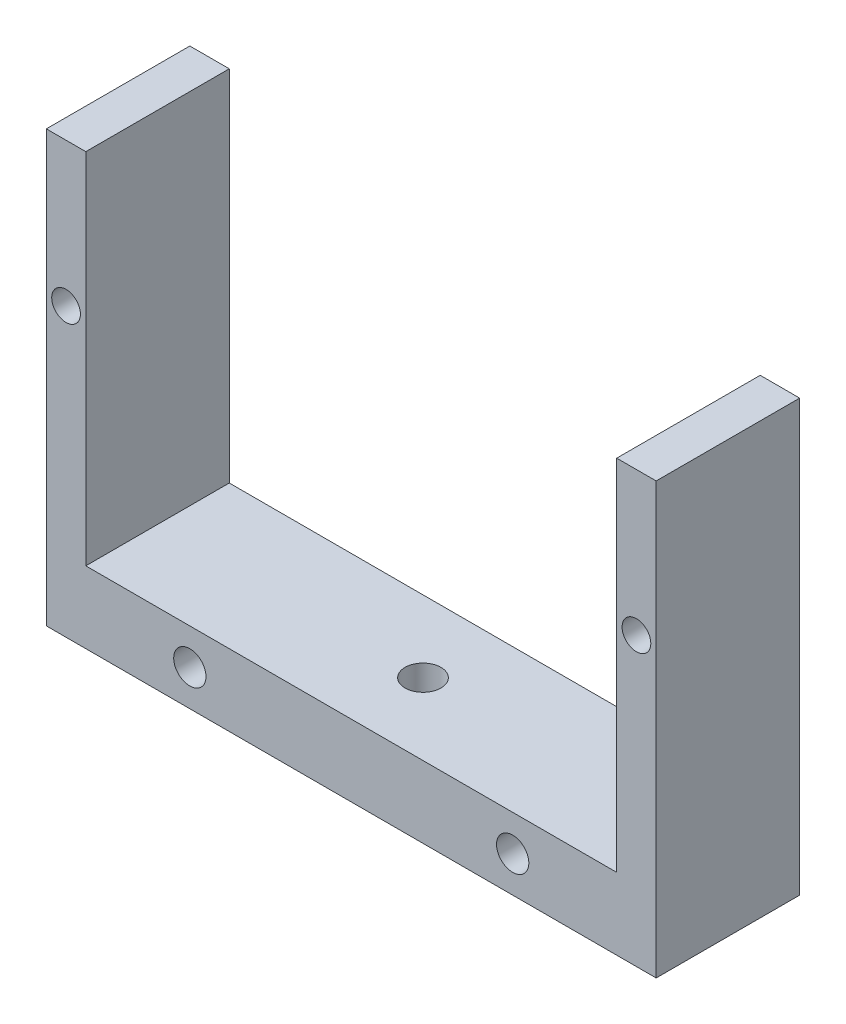
ISO-10303-21;
HEADER;
FILE_DESCRIPTION(('STEP AP214'),'2;1');
FILE_NAME('part.step','',(''),(''),'','','');
FILE_SCHEMA(('AUTOMOTIVE_DESIGN { 1 0 10303 214 1 1 1 1 }'));
ENDSEC;
DATA;
#1=APPLICATION_CONTEXT('core data for automotive mechanical design processes');
#2=APPLICATION_PROTOCOL_DEFINITION('international standard','automotive_design',2000,#1);
#3=PRODUCT_CONTEXT('',#1,'mechanical');
#4=PRODUCT('Part','Part','',(#3));
#5=PRODUCT_RELATED_PRODUCT_CATEGORY('part','',(#4));
#6=PRODUCT_DEFINITION_FORMATION('','',#4);
#7=PRODUCT_DEFINITION_CONTEXT('part definition',#1,'design');
#8=PRODUCT_DEFINITION('design','',#6,#7);
#9=PRODUCT_DEFINITION_SHAPE('','',#8);
#10=(LENGTH_UNIT() NAMED_UNIT(*) SI_UNIT(.MILLI.,.METRE.));
#11=(NAMED_UNIT(*) PLANE_ANGLE_UNIT() SI_UNIT($,.RADIAN.));
#12=(NAMED_UNIT(*) SI_UNIT($,.STERADIAN.) SOLID_ANGLE_UNIT());
#13=UNCERTAINTY_MEASURE_WITH_UNIT(LENGTH_MEASURE(1.E-05),#10,'distance_accuracy_value','');
#14=(GEOMETRIC_REPRESENTATION_CONTEXT(3) GLOBAL_UNCERTAINTY_ASSIGNED_CONTEXT((#13)) GLOBAL_UNIT_ASSIGNED_CONTEXT((#10,
#11,#12)) REPRESENTATION_CONTEXT('',''));
#15=CARTESIAN_POINT('',(0.,0.,0.));
#16=DIRECTION('',(0.,0.,1.));
#17=DIRECTION('',(1.,0.,0.));
#18=AXIS2_PLACEMENT_3D('',#15,#16,#17);
#19=CARTESIAN_POINT('',(-58.140719223104,13.8281957682953,20.));
#20=DIRECTION('',(1.,0.,0.));
#21=DIRECTION('',(0.,1.,0.));
#22=AXIS2_PLACEMENT_3D('',#19,#20,#21);
#23=PLANE('',#22);
#24=DIRECTION('',(0.,-1.,0.));
#25=VECTOR('',#24,1.);
#26=CARTESIAN_POINT('',(-58.140719223104,13.8281957682953,0.));
#27=LINE('',#26,#25);
#28=CARTESIAN_POINT('',(-58.140719223104,13.8281957682953,0.));
#29=VERTEX_POINT('',#28);
#30=CARTESIAN_POINT('',(-58.140719223104,-46.1718042317047,0.));
#31=VERTEX_POINT('',#30);
#32=EDGE_CURVE('E131',#29,#31,#27,.T.);
#33=ORIENTED_EDGE('',*,*,#32,.T.);
#34=DIRECTION('',(0.,0.,-1.));
#35=VECTOR('',#34,1.);
#36=CARTESIAN_POINT('',(-58.140719223104,-46.1718042317047,20.));
#37=LINE('',#36,#35);
#38=CARTESIAN_POINT('',(-58.140719223104,-46.1718042317047,20.));
#39=VERTEX_POINT('',#38);
#40=EDGE_CURVE('E11',#39,#31,#37,.T.);
#41=ORIENTED_EDGE('',*,*,#40,.F.);
#42=DIRECTION('',(0.,-1.,0.));
#43=VECTOR('',#42,1.);
#44=CARTESIAN_POINT('',(-58.140719223104,13.8281957682953,20.));
#45=LINE('',#44,#43);
#46=CARTESIAN_POINT('',(-58.140719223104,13.8281957682953,20.));
#47=VERTEX_POINT('',#46);
#48=EDGE_CURVE('E146',#47,#39,#45,.T.);
#49=ORIENTED_EDGE('',*,*,#48,.F.);
#50=DIRECTION('',(0.,0.,-1.));
#51=VECTOR('',#50,1.);
#52=CARTESIAN_POINT('',(-58.140719223104,13.8281957682953,20.));
#53=LINE('',#52,#51);
#54=EDGE_CURVE('E127',#47,#29,#53,.T.);
#55=ORIENTED_EDGE('',*,*,#54,.T.);
#56=EDGE_LOOP('',(#33,#41,#49,#55));
#57=FACE_BOUND('',#56,.T.);
#58=ADVANCED_FACE('F35',(#57),#23,.F.);
#59=CARTESIAN_POINT('',(-58.140719223104,-46.1718042317047,20.));
#60=DIRECTION('',(0.,1.,0.));
#61=DIRECTION('',(0.,0.,1.));
#62=AXIS2_PLACEMENT_3D('',#59,#60,#61);
#63=PLANE('',#62);
#64=CARTESIAN_POINT('',(-15.640719223104,-46.1718042317047,10.));
#65=DIRECTION('',(0.,1.,0.));
#66=DIRECTION('',(0.,0.,1.));
#67=AXIS2_PLACEMENT_3D('',#64,#65,#66);
#68=CIRCLE('',#67,2.5);
#69=CARTESIAN_POINT('',(-15.640719223104,-46.1718042317047,12.5));
#70=VERTEX_POINT('',#69);
#71=EDGE_CURVE('E202',#70,#70,#68,.F.);
#72=ORIENTED_EDGE('',*,*,#71,.F.);
#73=EDGE_LOOP('',(#72));
#74=FACE_BOUND('',#73,.T.);
#75=DIRECTION('',(1.,0.,0.));
#76=VECTOR('',#75,1.);
#77=CARTESIAN_POINT('',(-58.140719223104,-46.1718042317047,0.));
#78=LINE('',#77,#76);
#79=CARTESIAN_POINT('',(26.859280776896,-46.1718042317047,0.));
#80=VERTEX_POINT('',#79);
#81=EDGE_CURVE('E134',#31,#80,#78,.T.);
#82=ORIENTED_EDGE('',*,*,#81,.T.);
#83=DIRECTION('',(0.,0.,-1.));
#84=VECTOR('',#83,1.);
#85=CARTESIAN_POINT('',(26.859280776896,-46.1718042317047,20.));
#86=LINE('',#85,#84);
#87=CARTESIAN_POINT('',(26.859280776896,-46.1718042317047,20.));
#88=VERTEX_POINT('',#87);
#89=EDGE_CURVE('E43',#88,#80,#86,.T.);
#90=ORIENTED_EDGE('',*,*,#89,.F.);
#91=DIRECTION('',(1.,0.,0.));
#92=VECTOR('',#91,1.);
#93=CARTESIAN_POINT('',(-58.140719223104,-46.1718042317047,20.));
#94=LINE('',#93,#92);
#95=EDGE_CURVE('E94',#39,#88,#94,.T.);
#96=ORIENTED_EDGE('',*,*,#95,.F.);
#97=ORIENTED_EDGE('',*,*,#40,.T.);
#98=EDGE_LOOP('',(#82,#90,#96,#97));
#99=FACE_BOUND('',#98,.T.);
#100=ADVANCED_FACE('F224',(#74,#99),#63,.F.);
#101=CARTESIAN_POINT('',(26.859280776896,-46.1718042317047,20.));
#102=DIRECTION('',(-1.,0.,0.));
#103=DIRECTION('',(0.,0.,1.));
#104=AXIS2_PLACEMENT_3D('',#101,#102,#103);
#105=PLANE('',#104);
#106=DIRECTION('',(0.,1.,0.));
#107=VECTOR('',#106,1.);
#108=CARTESIAN_POINT('',(26.859280776896,-46.1718042317047,0.));
#109=LINE('',#108,#107);
#110=CARTESIAN_POINT('',(26.859280776896,13.8281957682953,0.));
#111=VERTEX_POINT('',#110);
#112=EDGE_CURVE('E137',#80,#111,#109,.T.);
#113=ORIENTED_EDGE('',*,*,#112,.T.);
#114=DIRECTION('',(0.,0.,-1.));
#115=VECTOR('',#114,1.);
#116=CARTESIAN_POINT('',(26.859280776896,13.8281957682953,20.));
#117=LINE('',#116,#115);
#118=CARTESIAN_POINT('',(26.859280776896,13.8281957682953,20.));
#119=VERTEX_POINT('',#118);
#120=EDGE_CURVE('E153',#119,#111,#117,.T.);
#121=ORIENTED_EDGE('',*,*,#120,.F.);
#122=DIRECTION('',(0.,1.,0.));
#123=VECTOR('',#122,1.);
#124=CARTESIAN_POINT('',(26.859280776896,-46.1718042317047,20.));
#125=LINE('',#124,#123);
#126=EDGE_CURVE('E161',#88,#119,#125,.T.);
#127=ORIENTED_EDGE('',*,*,#126,.F.);
#128=ORIENTED_EDGE('',*,*,#89,.T.);
#129=EDGE_LOOP('',(#113,#121,#127,#128));
#130=FACE_BOUND('',#129,.T.);
#131=ADVANCED_FACE('F159',(#130),#105,.F.);
#132=CARTESIAN_POINT('',(26.859280776896,13.8281957682953,20.));
#133=DIRECTION('',(0.,-1.,0.));
#134=DIRECTION('',(0.,0.,-1.));
#135=AXIS2_PLACEMENT_3D('',#132,#133,#134);
#136=PLANE('',#135);
#137=DIRECTION('',(-1.,0.,0.));
#138=VECTOR('',#137,1.);
#139=CARTESIAN_POINT('',(26.859280776896,13.8281957682953,0.));
#140=LINE('',#139,#138);
#141=CARTESIAN_POINT('',(21.359280776896,13.8281957682953,0.));
#142=VERTEX_POINT('',#141);
#143=EDGE_CURVE('E139',#111,#142,#140,.T.);
#144=ORIENTED_EDGE('',*,*,#143,.T.);
#145=DIRECTION('',(0.,0.,-1.));
#146=VECTOR('',#145,1.);
#147=CARTESIAN_POINT('',(21.359280776896,13.8281957682953,20.));
#148=LINE('',#147,#146);
#149=CARTESIAN_POINT('',(21.359280776896,13.8281957682953,20.));
#150=VERTEX_POINT('',#149);
#151=EDGE_CURVE('E150',#150,#142,#148,.T.);
#152=ORIENTED_EDGE('',*,*,#151,.F.);
#153=DIRECTION('',(-1.,0.,0.));
#154=VECTOR('',#153,1.);
#155=CARTESIAN_POINT('',(26.859280776896,13.8281957682953,20.));
#156=LINE('',#155,#154);
#157=EDGE_CURVE('E173',#119,#150,#156,.T.);
#158=ORIENTED_EDGE('',*,*,#157,.F.);
#159=ORIENTED_EDGE('',*,*,#120,.T.);
#160=EDGE_LOOP('',(#144,#152,#158,#159));
#161=FACE_BOUND('',#160,.T.);
#162=ADVANCED_FACE('F169',(#161),#136,.F.);
#163=CARTESIAN_POINT('',(21.359280776896,13.8281957682953,20.));
#164=DIRECTION('',(1.,0.,0.));
#165=DIRECTION('',(0.,1.,0.));
#166=AXIS2_PLACEMENT_3D('',#163,#164,#165);
#167=PLANE('',#166);
#168=DIRECTION('',(0.,-1.,0.));
#169=VECTOR('',#168,1.);
#170=CARTESIAN_POINT('',(21.359280776896,13.8281957682953,0.));
#171=LINE('',#170,#169);
#172=CARTESIAN_POINT('',(21.359280776896,-36.1718042317047,0.));
#173=VERTEX_POINT('',#172);
#174=EDGE_CURVE('E141',#142,#173,#171,.T.);
#175=ORIENTED_EDGE('',*,*,#174,.T.);
#176=DIRECTION('',(0.,0.,-1.));
#177=VECTOR('',#176,1.);
#178=CARTESIAN_POINT('',(21.359280776896,-36.1718042317047,20.));
#179=LINE('',#178,#177);
#180=CARTESIAN_POINT('',(21.359280776896,-36.1718042317047,20.));
#181=VERTEX_POINT('',#180);
#182=EDGE_CURVE('E122',#181,#173,#179,.T.);
#183=ORIENTED_EDGE('',*,*,#182,.F.);
#184=DIRECTION('',(0.,-1.,0.));
#185=VECTOR('',#184,1.);
#186=CARTESIAN_POINT('',(21.359280776896,13.8281957682953,20.));
#187=LINE('',#186,#185);
#188=EDGE_CURVE('E113',#150,#181,#187,.T.);
#189=ORIENTED_EDGE('',*,*,#188,.F.);
#190=ORIENTED_EDGE('',*,*,#151,.T.);
#191=EDGE_LOOP('',(#175,#183,#189,#190));
#192=FACE_BOUND('',#191,.T.);
#193=ADVANCED_FACE('F172',(#192),#167,.F.);
#194=CARTESIAN_POINT('',(21.359280776896,-36.1718042317047,20.));
#195=DIRECTION('',(0.,-1.,0.));
#196=DIRECTION('',(1.,0.,0.));
#197=AXIS2_PLACEMENT_3D('',#194,#195,#196);
#198=PLANE('',#197);
#199=CARTESIAN_POINT('',(-15.640719223104,-36.1718042317047,10.));
#200=DIRECTION('',(0.,1.,0.));
#201=DIRECTION('',(-1.,0.,0.));
#202=AXIS2_PLACEMENT_3D('',#199,#200,#201);
#203=CIRCLE('',#202,2.5);
#204=CARTESIAN_POINT('',(-18.140719223104,-36.1718042317047,10.));
#205=VERTEX_POINT('',#204);
#206=EDGE_CURVE('E205',#205,#205,#203,.T.);
#207=ORIENTED_EDGE('',*,*,#206,.F.);
#208=EDGE_LOOP('',(#207));
#209=FACE_BOUND('',#208,.T.);
#210=DIRECTION('',(-1.,0.,0.));
#211=VECTOR('',#210,1.);
#212=CARTESIAN_POINT('',(21.359280776896,-36.1718042317047,0.));
#213=LINE('',#212,#211);
#214=CARTESIAN_POINT('',(-52.640719223104,-36.1718042317048,0.));
#215=VERTEX_POINT('',#214);
#216=EDGE_CURVE('E121',#173,#215,#213,.T.);
#217=ORIENTED_EDGE('',*,*,#216,.T.);
#218=DIRECTION('',(0.,0.,-1.));
#219=VECTOR('',#218,1.);
#220=CARTESIAN_POINT('',(-52.640719223104,-36.1718042317048,20.));
#221=LINE('',#220,#219);
#222=CARTESIAN_POINT('',(-52.640719223104,-36.1718042317048,20.));
#223=VERTEX_POINT('',#222);
#224=EDGE_CURVE('E118',#223,#215,#221,.T.);
#225=ORIENTED_EDGE('',*,*,#224,.F.);
#226=DIRECTION('',(-1.,0.,0.));
#227=VECTOR('',#226,1.);
#228=CARTESIAN_POINT('',(21.359280776896,-36.1718042317047,20.));
#229=LINE('',#228,#227);
#230=EDGE_CURVE('E107',#181,#223,#229,.T.);
#231=ORIENTED_EDGE('',*,*,#230,.F.);
#232=ORIENTED_EDGE('',*,*,#182,.T.);
#233=EDGE_LOOP('',(#217,#225,#231,#232));
#234=FACE_BOUND('',#233,.T.);
#235=ADVANCED_FACE('F119',(#209,#234),#198,.F.);
#236=CARTESIAN_POINT('',(-52.640719223104,-36.1718042317048,20.));
#237=DIRECTION('',(-1.,0.,0.));
#238=DIRECTION('',(0.,0.,1.));
#239=AXIS2_PLACEMENT_3D('',#236,#237,#238);
#240=PLANE('',#239);
#241=DIRECTION('',(0.,1.,0.));
#242=VECTOR('',#241,1.);
#243=CARTESIAN_POINT('',(-52.640719223104,-36.1718042317048,0.));
#244=LINE('',#243,#242);
#245=CARTESIAN_POINT('',(-52.640719223104,13.8281957682953,0.));
#246=VERTEX_POINT('',#245);
#247=EDGE_CURVE('E80',#215,#246,#244,.T.);
#248=ORIENTED_EDGE('',*,*,#247,.T.);
#249=DIRECTION('',(0.,0.,-1.));
#250=VECTOR('',#249,1.);
#251=CARTESIAN_POINT('',(-52.640719223104,13.8281957682953,20.));
#252=LINE('',#251,#250);
#253=CARTESIAN_POINT('',(-52.640719223104,13.8281957682953,20.));
#254=VERTEX_POINT('',#253);
#255=EDGE_CURVE('E123',#254,#246,#252,.T.);
#256=ORIENTED_EDGE('',*,*,#255,.F.);
#257=DIRECTION('',(0.,1.,0.));
#258=VECTOR('',#257,1.);
#259=CARTESIAN_POINT('',(-52.640719223104,-36.1718042317048,20.));
#260=LINE('',#259,#258);
#261=EDGE_CURVE('E111',#223,#254,#260,.T.);
#262=ORIENTED_EDGE('',*,*,#261,.F.);
#263=ORIENTED_EDGE('',*,*,#224,.T.);
#264=EDGE_LOOP('',(#248,#256,#262,#263));
#265=FACE_BOUND('',#264,.T.);
#266=ADVANCED_FACE('F125',(#265),#240,.F.);
#267=CARTESIAN_POINT('',(-52.640719223104,13.8281957682953,20.));
#268=DIRECTION('',(0.,-1.,0.));
#269=DIRECTION('',(1.,0.,0.));
#270=AXIS2_PLACEMENT_3D('',#267,#268,#269);
#271=PLANE('',#270);
#272=DIRECTION('',(-1.,0.,0.));
#273=VECTOR('',#272,1.);
#274=CARTESIAN_POINT('',(-52.640719223104,13.8281957682953,0.));
#275=LINE('',#274,#273);
#276=EDGE_CURVE('E86',#246,#29,#275,.T.);
#277=ORIENTED_EDGE('',*,*,#276,.T.);
#278=ORIENTED_EDGE('',*,*,#54,.F.);
#279=DIRECTION('',(-1.,0.,0.));
#280=VECTOR('',#279,1.);
#281=CARTESIAN_POINT('',(-52.640719223104,13.8281957682953,20.));
#282=LINE('',#281,#280);
#283=EDGE_CURVE('E51',#254,#47,#282,.T.);
#284=ORIENTED_EDGE('',*,*,#283,.F.);
#285=ORIENTED_EDGE('',*,*,#255,.T.);
#286=EDGE_LOOP('',(#277,#278,#284,#285));
#287=FACE_BOUND('',#286,.T.);
#288=ADVANCED_FACE('F219',(#287),#271,.F.);
#289=CARTESIAN_POINT('',(0.,0.,20.));
#290=DIRECTION('',(0.,0.,1.));
#291=DIRECTION('',(1.,0.,0.));
#292=AXIS2_PLACEMENT_3D('',#289,#290,#291);
#293=PLANE('',#292);
#294=CARTESIAN_POINT('',(24.109280776896,-6.17180423170475,20.));
#295=DIRECTION('',(0.,0.,1.));
#296=DIRECTION('',(1.,0.,0.));
#297=AXIS2_PLACEMENT_3D('',#294,#295,#296);
#298=CIRCLE('',#297,2.);
#299=CARTESIAN_POINT('',(26.109280776896,-6.17180423170475,20.));
#300=VERTEX_POINT('',#299);
#301=EDGE_CURVE('E199',#300,#300,#298,.T.);
#302=ORIENTED_EDGE('',*,*,#301,.F.);
#303=EDGE_LOOP('',(#302));
#304=FACE_BOUND('',#303,.T.);
#305=CARTESIAN_POINT('',(-55.390719223104,-6.17180423170475,20.));
#306=DIRECTION('',(0.,0.,1.));
#307=DIRECTION('',(1.,0.,0.));
#308=AXIS2_PLACEMENT_3D('',#305,#306,#307);
#309=CIRCLE('',#308,2.);
#310=CARTESIAN_POINT('',(-53.390719223104,-6.17180423170475,20.));
#311=VERTEX_POINT('',#310);
#312=EDGE_CURVE('E193',#311,#311,#309,.T.);
#313=ORIENTED_EDGE('',*,*,#312,.F.);
#314=EDGE_LOOP('',(#313));
#315=FACE_BOUND('',#314,.T.);
#316=CARTESIAN_POINT('',(-38.140719223104,-41.1718042317047,20.));
#317=DIRECTION('',(0.,0.,-1.));
#318=DIRECTION('',(-1.,0.,0.));
#319=AXIS2_PLACEMENT_3D('',#316,#317,#318);
#320=CIRCLE('',#319,2.25);
#321=CARTESIAN_POINT('',(-40.390719223104,-41.1718042317047,20.));
#322=VERTEX_POINT('',#321);
#323=EDGE_CURVE('E182',#322,#322,#320,.T.);
#324=ORIENTED_EDGE('',*,*,#323,.T.);
#325=EDGE_LOOP('',(#324));
#326=FACE_BOUND('',#325,.T.);
#327=CARTESIAN_POINT('',(6.85928077689598,-41.1718042317047,20.));
#328=DIRECTION('',(0.,0.,-1.));
#329=DIRECTION('',(-1.,0.,0.));
#330=AXIS2_PLACEMENT_3D('',#327,#328,#329);
#331=CIRCLE('',#330,2.25);
#332=CARTESIAN_POINT('',(4.60928077689598,-41.1718042317047,20.));
#333=VERTEX_POINT('',#332);
#334=EDGE_CURVE('E135',#333,#333,#331,.T.);
#335=ORIENTED_EDGE('',*,*,#334,.T.);
#336=EDGE_LOOP('',(#335));
#337=FACE_BOUND('',#336,.T.);
#338=ORIENTED_EDGE('',*,*,#48,.T.);
#339=ORIENTED_EDGE('',*,*,#95,.T.);
#340=ORIENTED_EDGE('',*,*,#126,.T.);
#341=ORIENTED_EDGE('',*,*,#157,.T.);
#342=ORIENTED_EDGE('',*,*,#188,.T.);
#343=ORIENTED_EDGE('',*,*,#230,.T.);
#344=ORIENTED_EDGE('',*,*,#261,.T.);
#345=ORIENTED_EDGE('',*,*,#283,.T.);
#346=EDGE_LOOP('',(#338,#339,#340,#341,#342,#343,#344,#345));
#347=FACE_BOUND('',#346,.T.);
#348=ADVANCED_FACE('F109',(#304,#315,#326,#337,#347),#293,.T.);
#349=CARTESIAN_POINT('',(0.,0.,0.));
#350=DIRECTION('',(0.,0.,1.));
#351=DIRECTION('',(1.,0.,0.));
#352=AXIS2_PLACEMENT_3D('',#349,#350,#351);
#353=PLANE('',#352);
#354=CARTESIAN_POINT('',(24.109280776896,-6.17180423170475,0.));
#355=DIRECTION('',(0.,0.,1.));
#356=DIRECTION('',(1.,0.,0.));
#357=AXIS2_PLACEMENT_3D('',#354,#355,#356);
#358=CIRCLE('',#357,2.);
#359=CARTESIAN_POINT('',(26.109280776896,-6.17180423170475,0.));
#360=VERTEX_POINT('',#359);
#361=EDGE_CURVE('E196',#360,#360,#358,.F.);
#362=ORIENTED_EDGE('',*,*,#361,.F.);
#363=EDGE_LOOP('',(#362));
#364=FACE_BOUND('',#363,.T.);
#365=CARTESIAN_POINT('',(-55.390719223104,-6.17180423170475,0.));
#366=DIRECTION('',(0.,0.,1.));
#367=DIRECTION('',(1.,0.,0.));
#368=AXIS2_PLACEMENT_3D('',#365,#366,#367);
#369=CIRCLE('',#368,2.);
#370=CARTESIAN_POINT('',(-53.390719223104,-6.17180423170475,0.));
#371=VERTEX_POINT('',#370);
#372=EDGE_CURVE('E188',#371,#371,#369,.F.);
#373=ORIENTED_EDGE('',*,*,#372,.F.);
#374=EDGE_LOOP('',(#373));
#375=FACE_BOUND('',#374,.T.);
#376=CARTESIAN_POINT('',(-38.140719223104,-41.1718042317047,0.));
#377=DIRECTION('',(0.,0.,-1.));
#378=DIRECTION('',(-1.,0.,0.));
#379=AXIS2_PLACEMENT_3D('',#376,#377,#378);
#380=CIRCLE('',#379,2.25);
#381=CARTESIAN_POINT('',(-40.390719223104,-41.1718042317047,0.));
#382=VERTEX_POINT('',#381);
#383=EDGE_CURVE('E185',#382,#382,#380,.T.);
#384=ORIENTED_EDGE('',*,*,#383,.F.);
#385=EDGE_LOOP('',(#384));
#386=FACE_BOUND('',#385,.T.);
#387=CARTESIAN_POINT('',(6.85928077689598,-41.1718042317047,0.));
#388=DIRECTION('',(0.,0.,-1.));
#389=DIRECTION('',(-1.,0.,0.));
#390=AXIS2_PLACEMENT_3D('',#387,#388,#389);
#391=CIRCLE('',#390,2.25);
#392=CARTESIAN_POINT('',(4.60928077689598,-41.1718042317047,0.));
#393=VERTEX_POINT('',#392);
#394=EDGE_CURVE('E179',#393,#393,#391,.T.);
#395=ORIENTED_EDGE('',*,*,#394,.F.);
#396=EDGE_LOOP('',(#395));
#397=FACE_BOUND('',#396,.T.);
#398=ORIENTED_EDGE('',*,*,#32,.F.);
#399=ORIENTED_EDGE('',*,*,#276,.F.);
#400=ORIENTED_EDGE('',*,*,#247,.F.);
#401=ORIENTED_EDGE('',*,*,#216,.F.);
#402=ORIENTED_EDGE('',*,*,#174,.F.);
#403=ORIENTED_EDGE('',*,*,#143,.F.);
#404=ORIENTED_EDGE('',*,*,#112,.F.);
#405=ORIENTED_EDGE('',*,*,#81,.F.);
#406=EDGE_LOOP('',(#398,#399,#400,#401,#402,#403,#404,#405));
#407=FACE_BOUND('',#406,.T.);
#408=ADVANCED_FACE('F165',(#364,#375,#386,#397,#407),#353,.F.);
#409=CARTESIAN_POINT('',(6.85928077689598,-41.1718042317047,20.));
#410=DIRECTION('',(0.,0.,-1.));
#411=DIRECTION('',(-1.,0.,0.));
#412=AXIS2_PLACEMENT_3D('',#409,#410,#411);
#413=CYLINDRICAL_SURFACE('',#412,2.25);
#414=ORIENTED_EDGE('',*,*,#334,.F.);
#415=EDGE_LOOP('',(#414));
#416=FACE_BOUND('',#415,.T.);
#417=ORIENTED_EDGE('',*,*,#394,.T.);
#418=EDGE_LOOP('',(#417));
#419=FACE_BOUND('',#418,.T.);
#420=ADVANCED_FACE('F242',(#416,#419),#413,.F.);
#421=CARTESIAN_POINT('',(-38.140719223104,-41.1718042317047,20.));
#422=DIRECTION('',(0.,0.,-1.));
#423=DIRECTION('',(-1.,0.,0.));
#424=AXIS2_PLACEMENT_3D('',#421,#422,#423);
#425=CYLINDRICAL_SURFACE('',#424,2.25);
#426=ORIENTED_EDGE('',*,*,#323,.F.);
#427=EDGE_LOOP('',(#426));
#428=FACE_BOUND('',#427,.T.);
#429=ORIENTED_EDGE('',*,*,#383,.T.);
#430=EDGE_LOOP('',(#429));
#431=FACE_BOUND('',#430,.T.);
#432=ADVANCED_FACE('F247',(#428,#431),#425,.F.);
#433=CARTESIAN_POINT('',(-55.390719223104,-6.17180423170475,-0.001000000000001));
#434=DIRECTION('',(0.,0.,1.));
#435=DIRECTION('',(1.,0.,0.));
#436=AXIS2_PLACEMENT_3D('',#433,#434,#435);
#437=CYLINDRICAL_SURFACE('',#436,2.);
#438=ORIENTED_EDGE('',*,*,#312,.T.);
#439=EDGE_LOOP('',(#438));
#440=FACE_BOUND('',#439,.T.);
#441=ORIENTED_EDGE('',*,*,#372,.T.);
#442=EDGE_LOOP('',(#441));
#443=FACE_BOUND('',#442,.T.);
#444=ADVANCED_FACE('F251',(#440,#443),#437,.F.);
#445=CARTESIAN_POINT('',(24.109280776896,-6.17180423170475,-0.001000000000001));
#446=DIRECTION('',(0.,0.,1.));
#447=DIRECTION('',(1.,0.,0.));
#448=AXIS2_PLACEMENT_3D('',#445,#446,#447);
#449=CYLINDRICAL_SURFACE('',#448,2.);
#450=ORIENTED_EDGE('',*,*,#301,.T.);
#451=EDGE_LOOP('',(#450));
#452=FACE_BOUND('',#451,.T.);
#453=ORIENTED_EDGE('',*,*,#361,.T.);
#454=EDGE_LOOP('',(#453));
#455=FACE_BOUND('',#454,.T.);
#456=ADVANCED_FACE('F255',(#452,#455),#449,.F.);
#457=CARTESIAN_POINT('',(-15.640719223104,-46.1728042317048,10.));
#458=DIRECTION('',(0.,1.,0.));
#459=DIRECTION('',(-1.,0.,0.));
#460=AXIS2_PLACEMENT_3D('',#457,#458,#459);
#461=CYLINDRICAL_SURFACE('',#460,2.5);
#462=ORIENTED_EDGE('',*,*,#206,.T.);
#463=EDGE_LOOP('',(#462));
#464=FACE_BOUND('',#463,.T.);
#465=ORIENTED_EDGE('',*,*,#71,.T.);
#466=EDGE_LOOP('',(#465));
#467=FACE_BOUND('',#466,.T.);
#468=ADVANCED_FACE('F209',(#464,#467),#461,.F.);
#469=CLOSED_SHELL('',(#58,#100,#131,#162,#193,#235,#266,#288,#348,#408,#420,#432,#444,#456,#468));
#470=MANIFOLD_SOLID_BREP('B2',#469);
#471=ADVANCED_BREP_SHAPE_REPRESENTATION('',(#18,#470),#14);
#472=SHAPE_DEFINITION_REPRESENTATION(#9,#471);
ENDSEC;
END-ISO-10303-21;
